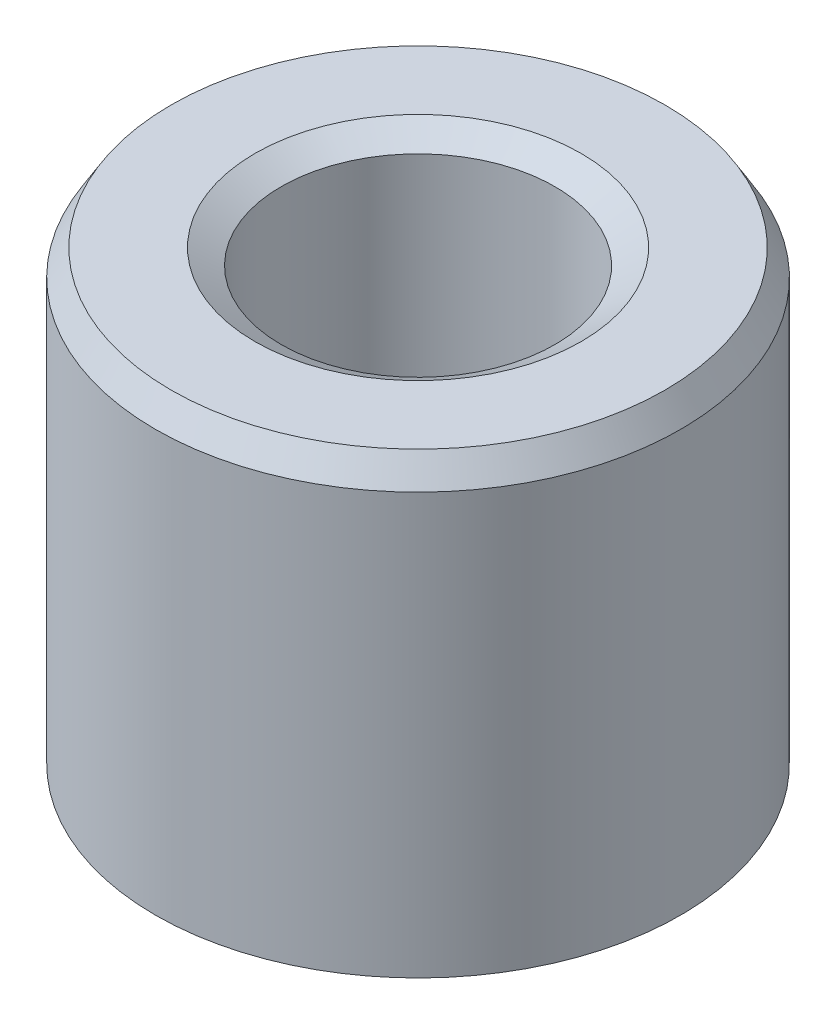
ISO-10303-21;
HEADER;
FILE_DESCRIPTION(('STEP AP214'),'2;1');
FILE_NAME('part.step','',(''),(''),'','','');
FILE_SCHEMA(('AUTOMOTIVE_DESIGN { 1 0 10303 214 1 1 1 1 }'));
ENDSEC;
DATA;
#1=APPLICATION_CONTEXT('core data for automotive mechanical design processes');
#2=APPLICATION_PROTOCOL_DEFINITION('international standard','automotive_design',2000,#1);
#3=PRODUCT_CONTEXT('',#1,'mechanical');
#4=PRODUCT('Part','Part','',(#3));
#5=PRODUCT_RELATED_PRODUCT_CATEGORY('part','',(#4));
#6=PRODUCT_DEFINITION_FORMATION('','',#4);
#7=PRODUCT_DEFINITION_CONTEXT('part definition',#1,'design');
#8=PRODUCT_DEFINITION('design','',#6,#7);
#9=PRODUCT_DEFINITION_SHAPE('','',#8);
#10=(LENGTH_UNIT() NAMED_UNIT(*) SI_UNIT(.MILLI.,.METRE.));
#11=(NAMED_UNIT(*) PLANE_ANGLE_UNIT() SI_UNIT($,.RADIAN.));
#12=(NAMED_UNIT(*) SI_UNIT($,.STERADIAN.) SOLID_ANGLE_UNIT());
#13=UNCERTAINTY_MEASURE_WITH_UNIT(LENGTH_MEASURE(1.E-05),#10,'distance_accuracy_value','');
#14=(GEOMETRIC_REPRESENTATION_CONTEXT(3) GLOBAL_UNCERTAINTY_ASSIGNED_CONTEXT((#13)) GLOBAL_UNIT_ASSIGNED_CONTEXT((#10,
#11,#12)) REPRESENTATION_CONTEXT('',''));
#15=CARTESIAN_POINT('',(0.,0.,0.));
#16=DIRECTION('',(0.,0.,1.));
#17=DIRECTION('',(1.,0.,0.));
#18=AXIS2_PLACEMENT_3D('',#15,#16,#17);
#19=CARTESIAN_POINT('',(0.,17.613700112025,0.));
#20=DIRECTION('',(0.,-1.,0.));
#21=DIRECTION('',(0.,0.,-1.));
#22=AXIS2_PLACEMENT_3D('',#19,#20,#21);
#23=CYLINDRICAL_SURFACE('',#22,10.);
#24=CARTESIAN_POINT('',(0.,0.595959459733519,0.));
#25=DIRECTION('',(0.,1.,0.));
#26=DIRECTION('',(0.,0.,1.));
#27=AXIS2_PLACEMENT_3D('',#24,#25,#26);
#28=CIRCLE('',#27,10.);
#29=CARTESIAN_POINT('',(0.,0.595959459733519,10.));
#30=VERTEX_POINT('',#29);
#31=EDGE_CURVE('E10',#30,#30,#28,.T.);
#32=ORIENTED_EDGE('',*,*,#31,.T.);
#33=EDGE_LOOP('',(#32));
#34=FACE_BOUND('',#33,.T.);
#35=CARTESIAN_POINT('',(0.,16.6164831555811,0.));
#36=DIRECTION('',(0.,1.,0.));
#37=DIRECTION('',(0.,0.,1.));
#38=AXIS2_PLACEMENT_3D('',#35,#36,#37);
#39=CIRCLE('',#38,10.);
#40=CARTESIAN_POINT('',(0.,16.6164831555811,10.));
#41=VERTEX_POINT('',#40);
#42=EDGE_CURVE('E50',#41,#41,#39,.F.);
#43=ORIENTED_EDGE('',*,*,#42,.T.);
#44=EDGE_LOOP('',(#43));
#45=FACE_BOUND('',#44,.T.);
#46=ADVANCED_FACE('F39',(#34,#45),#23,.T.);
#47=CARTESIAN_POINT('',(0.,17.613700112025,0.));
#48=DIRECTION('',(0.,1.,0.));
#49=DIRECTION('',(0.,0.,1.));
#50=AXIS2_PLACEMENT_3D('',#47,#48,#49);
#51=PLANE('',#50);
#52=CARTESIAN_POINT('',(0.,17.613700112025,0.));
#53=DIRECTION('',(0.,1.,0.));
#54=DIRECTION('',(0.,0.,1.));
#55=AXIS2_PLACEMENT_3D('',#52,#53,#54);
#56=CIRCLE('',#55,6.20875059695473);
#57=CARTESIAN_POINT('',(0.,17.613700112025,6.20875059695473));
#58=VERTEX_POINT('',#57);
#59=EDGE_CURVE('E58',#58,#58,#56,.F.);
#60=ORIENTED_EDGE('',*,*,#59,.T.);
#61=EDGE_LOOP('',(#60));
#62=FACE_BOUND('',#61,.T.);
#63=CARTESIAN_POINT('',(0.,17.613700112025,0.));
#64=DIRECTION('',(0.,1.,0.));
#65=DIRECTION('',(0.,0.,1.));
#66=AXIS2_PLACEMENT_3D('',#63,#64,#65);
#67=CIRCLE('',#66,9.40404054026648);
#68=CARTESIAN_POINT('',(0.,17.613700112025,9.40404054026648));
#69=VERTEX_POINT('',#68);
#70=EDGE_CURVE('E61',#69,#69,#67,.T.);
#71=ORIENTED_EDGE('',*,*,#70,.T.);
#72=EDGE_LOOP('',(#71));
#73=FACE_BOUND('',#72,.T.);
#74=ADVANCED_FACE('F88',(#62,#73),#51,.T.);
#75=CARTESIAN_POINT('',(0.,0.,0.));
#76=DIRECTION('',(0.,1.,0.));
#77=DIRECTION('',(0.,0.,1.));
#78=AXIS2_PLACEMENT_3D('',#75,#76,#77);
#79=PLANE('',#78);
#80=CARTESIAN_POINT('',(0.,0.,0.));
#81=DIRECTION('',(0.,1.,0.));
#82=DIRECTION('',(0.,0.,1.));
#83=AXIS2_PLACEMENT_3D('',#80,#81,#82);
#84=CIRCLE('',#83,5.80749310024429);
#85=CARTESIAN_POINT('',(0.,0.,5.80749310024429));
#86=VERTEX_POINT('',#85);
#87=EDGE_CURVE('E51',#86,#86,#84,.T.);
#88=ORIENTED_EDGE('',*,*,#87,.T.);
#89=EDGE_LOOP('',(#88));
#90=FACE_BOUND('',#89,.T.);
#91=CARTESIAN_POINT('',(0.,0.,0.));
#92=DIRECTION('',(0.,1.,0.));
#93=DIRECTION('',(0.,0.,1.));
#94=AXIS2_PLACEMENT_3D('',#91,#92,#93);
#95=CIRCLE('',#94,9.00278304355605);
#96=CARTESIAN_POINT('',(0.,0.,9.00278304355605));
#97=VERTEX_POINT('',#96);
#98=EDGE_CURVE('E54',#97,#97,#95,.F.);
#99=ORIENTED_EDGE('',*,*,#98,.T.);
#100=EDGE_LOOP('',(#99));
#101=FACE_BOUND('',#100,.T.);
#102=ADVANCED_FACE('F83',(#90,#101),#79,.F.);
#103=CARTESIAN_POINT('',(0.,17.613700112025,0.));
#104=DIRECTION('',(0.,-1.,0.));
#105=DIRECTION('',(0.,0.,-1.));
#106=AXIS2_PLACEMENT_3D('',#103,#104,#105);
#107=CYLINDRICAL_SURFACE('',#106,5.21153364051077);
#108=CARTESIAN_POINT('',(0.,17.0177406522915,0.));
#109=DIRECTION('',(0.,1.,0.));
#110=DIRECTION('',(0.,0.,1.));
#111=AXIS2_PLACEMENT_3D('',#108,#109,#110);
#112=CIRCLE('',#111,5.21153364051077);
#113=CARTESIAN_POINT('',(0.,17.0177406522915,5.21153364051077));
#114=VERTEX_POINT('',#113);
#115=EDGE_CURVE('E67',#114,#114,#112,.T.);
#116=ORIENTED_EDGE('',*,*,#115,.T.);
#117=EDGE_LOOP('',(#116));
#118=FACE_BOUND('',#117,.T.);
#119=CARTESIAN_POINT('',(0.,0.99721695644395,0.));
#120=DIRECTION('',(0.,1.,0.));
#121=DIRECTION('',(0.,0.,1.));
#122=AXIS2_PLACEMENT_3D('',#119,#120,#121);
#123=CIRCLE('',#122,5.21153364051077);
#124=CARTESIAN_POINT('',(0.,0.99721695644395,5.21153364051077));
#125=VERTEX_POINT('',#124);
#126=EDGE_CURVE('E69',#125,#125,#123,.F.);
#127=ORIENTED_EDGE('',*,*,#126,.T.);
#128=EDGE_LOOP('',(#127));
#129=FACE_BOUND('',#128,.T.);
#130=ADVANCED_FACE('F71',(#118,#129),#107,.F.);
#131=CARTESIAN_POINT('',(0.,17.0177406522915,0.));
#132=DIRECTION('',(0.,1.,0.));
#133=DIRECTION('',(0.,0.,1.));
#134=AXIS2_PLACEMENT_3D('',#131,#132,#133);
#135=CONICAL_SURFACE('',#134,5.21153364051077,1.03212669706288);
#136=ORIENTED_EDGE('',*,*,#59,.F.);
#137=EDGE_LOOP('',(#136));
#138=FACE_BOUND('',#137,.T.);
#139=ORIENTED_EDGE('',*,*,#115,.F.);
#140=EDGE_LOOP('',(#139));
#141=FACE_BOUND('',#140,.T.);
#142=ADVANCED_FACE('F77',(#138,#141),#135,.F.);
#143=CARTESIAN_POINT('',(0.,0.,0.));
#144=DIRECTION('',(0.,-1.,0.));
#145=DIRECTION('',(0.,0.,-1.));
#146=AXIS2_PLACEMENT_3D('',#143,#144,#145);
#147=CONICAL_SURFACE('',#146,5.80749310024429,0.538669629732016);
#148=ORIENTED_EDGE('',*,*,#126,.F.);
#149=EDGE_LOOP('',(#148));
#150=FACE_BOUND('',#149,.T.);
#151=ORIENTED_EDGE('',*,*,#87,.F.);
#152=EDGE_LOOP('',(#151));
#153=FACE_BOUND('',#152,.T.);
#154=ADVANCED_FACE('F73',(#150,#153),#147,.F.);
#155=CARTESIAN_POINT('',(0.,0.595959459733519,0.));
#156=DIRECTION('',(0.,1.,0.));
#157=DIRECTION('',(0.,0.,1.));
#158=AXIS2_PLACEMENT_3D('',#155,#156,#157);
#159=CONICAL_SURFACE('',#158,10.,1.03212669706288);
#160=ORIENTED_EDGE('',*,*,#98,.F.);
#161=EDGE_LOOP('',(#160));
#162=FACE_BOUND('',#161,.T.);
#163=ORIENTED_EDGE('',*,*,#31,.F.);
#164=EDGE_LOOP('',(#163));
#165=FACE_BOUND('',#164,.T.);
#166=ADVANCED_FACE('F76',(#162,#165),#159,.T.);
#167=CARTESIAN_POINT('',(0.,17.613700112025,0.));
#168=DIRECTION('',(0.,-1.,0.));
#169=DIRECTION('',(0.,0.,-1.));
#170=AXIS2_PLACEMENT_3D('',#167,#168,#169);
#171=CONICAL_SURFACE('',#170,9.40404054026648,0.538669629732014);
#172=ORIENTED_EDGE('',*,*,#42,.F.);
#173=EDGE_LOOP('',(#172));
#174=FACE_BOUND('',#173,.T.);
#175=ORIENTED_EDGE('',*,*,#70,.F.);
#176=EDGE_LOOP('',(#175));
#177=FACE_BOUND('',#176,.T.);
#178=ADVANCED_FACE('F45',(#174,#177),#171,.T.);
#179=CLOSED_SHELL('',(#46,#74,#102,#130,#142,#154,#166,#178));
#180=MANIFOLD_SOLID_BREP('B2',#179);
#181=ADVANCED_BREP_SHAPE_REPRESENTATION('',(#18,#180),#14);
#182=SHAPE_DEFINITION_REPRESENTATION(#9,#181);
ENDSEC;
END-ISO-10303-21;
